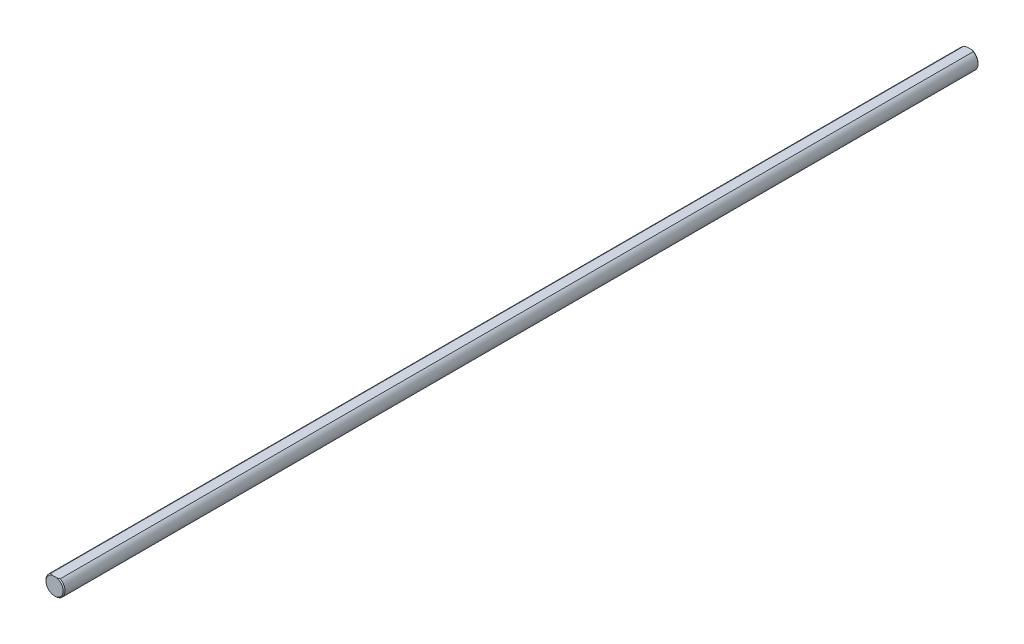
ISO-10303-21;
HEADER;
FILE_DESCRIPTION(('STEP AP214'),'2;1');
FILE_NAME('part.step','',(''),(''),'','','');
FILE_SCHEMA(('AUTOMOTIVE_DESIGN { 1 0 10303 214 1 1 1 1 }'));
ENDSEC;
DATA;
#1=APPLICATION_CONTEXT('core data for automotive mechanical design processes');
#2=APPLICATION_PROTOCOL_DEFINITION('international standard','automotive_design',2000,#1);
#3=PRODUCT_CONTEXT('',#1,'mechanical');
#4=PRODUCT('Part','Part','',(#3));
#5=PRODUCT_RELATED_PRODUCT_CATEGORY('part','',(#4));
#6=PRODUCT_DEFINITION_FORMATION('','',#4);
#7=PRODUCT_DEFINITION_CONTEXT('part definition',#1,'design');
#8=PRODUCT_DEFINITION('design','',#6,#7);
#9=PRODUCT_DEFINITION_SHAPE('','',#8);
#10=(LENGTH_UNIT() NAMED_UNIT(*) SI_UNIT(.MILLI.,.METRE.));
#11=(NAMED_UNIT(*) PLANE_ANGLE_UNIT() SI_UNIT($,.RADIAN.));
#12=(NAMED_UNIT(*) SI_UNIT($,.STERADIAN.) SOLID_ANGLE_UNIT());
#13=UNCERTAINTY_MEASURE_WITH_UNIT(LENGTH_MEASURE(1.E-05),#10,'distance_accuracy_value','');
#14=(GEOMETRIC_REPRESENTATION_CONTEXT(3) GLOBAL_UNCERTAINTY_ASSIGNED_CONTEXT((#13)) GLOBAL_UNIT_ASSIGNED_CONTEXT((#10,
#11,#12)) REPRESENTATION_CONTEXT('',''));
#15=CARTESIAN_POINT('',(0.,0.,0.));
#16=DIRECTION('',(0.,0.,1.));
#17=DIRECTION('',(1.,0.,0.));
#18=AXIS2_PLACEMENT_3D('',#15,#16,#17);
#19=CARTESIAN_POINT('',(0.,0.,152.4));
#20=DIRECTION('',(0.,0.,-1.));
#21=DIRECTION('',(-1.,0.,0.));
#22=AXIS2_PLACEMENT_3D('',#19,#20,#21);
#23=CYLINDRICAL_SURFACE('',#22,3.175);
#24=DIRECTION('',(0.,0.,1.));
#25=VECTOR('',#24,1.);
#26=CARTESIAN_POINT('',(-1.5875,2.74963065701559,-152.4));
#27=LINE('',#26,#25);
#28=CARTESIAN_POINT('',(-1.5875,2.74963065701559,-152.0825));
#29=VERTEX_POINT('',#28);
#30=CARTESIAN_POINT('',(-1.5875,2.74963065701559,152.0825));
#31=VERTEX_POINT('',#30);
#32=EDGE_CURVE('E79',#29,#31,#27,.T.);
#33=ORIENTED_EDGE('',*,*,#32,.F.);
#34=CARTESIAN_POINT('',(0.,0.,-152.0825));
#35=DIRECTION('',(0.,0.,1.));
#36=DIRECTION('',(1.,0.,0.));
#37=AXIS2_PLACEMENT_3D('',#34,#35,#36);
#38=CIRCLE('',#37,3.175);
#39=CARTESIAN_POINT('',(1.5875,2.74963065701559,-152.0825));
#40=VERTEX_POINT('',#39);
#41=EDGE_CURVE('E90',#29,#40,#38,.T.);
#42=ORIENTED_EDGE('',*,*,#41,.T.);
#43=DIRECTION('',(0.,0.,1.));
#44=VECTOR('',#43,1.);
#45=CARTESIAN_POINT('',(1.5875,2.74963065701559,-152.4));
#46=LINE('',#45,#44);
#47=CARTESIAN_POINT('',(1.5875,2.74963065701559,152.0825));
#48=VERTEX_POINT('',#47);
#49=EDGE_CURVE('E92',#40,#48,#46,.T.);
#50=ORIENTED_EDGE('',*,*,#49,.T.);
#51=CARTESIAN_POINT('',(0.,0.,152.0825));
#52=DIRECTION('',(0.,0.,1.));
#53=DIRECTION('',(1.,0.,0.));
#54=AXIS2_PLACEMENT_3D('',#51,#52,#53);
#55=CIRCLE('',#54,3.175);
#56=EDGE_CURVE('E91',#48,#31,#55,.F.);
#57=ORIENTED_EDGE('',*,*,#56,.T.);
#58=EDGE_LOOP('',(#33,#42,#50,#57));
#59=FACE_BOUND('',#58,.T.);
#60=ADVANCED_FACE('F32',(#59),#23,.T.);
#61=CARTESIAN_POINT('',(0.,0.,152.4));
#62=DIRECTION('',(0.,0.,1.));
#63=DIRECTION('',(1.,0.,0.));
#64=AXIS2_PLACEMENT_3D('',#61,#62,#63);
#65=PLANE('',#64);
#66=DIRECTION('',(1.,0.,0.));
#67=VECTOR('',#66,1.);
#68=CARTESIAN_POINT('',(-1.5875,2.74963065701559,152.4));
#69=LINE('',#68,#67);
#70=CARTESIAN_POINT('',(-0.777712993334318,2.74963065701559,152.4));
#71=VERTEX_POINT('',#70);
#72=CARTESIAN_POINT('',(0.777712993334318,2.74963065701559,152.4));
#73=VERTEX_POINT('',#72);
#74=EDGE_CURVE('E137',#71,#73,#69,.T.);
#75=ORIENTED_EDGE('',*,*,#74,.F.);
#76=CARTESIAN_POINT('',(0.,0.,152.4));
#77=DIRECTION('',(0.,0.,1.));
#78=DIRECTION('',(1.,0.,0.));
#79=AXIS2_PLACEMENT_3D('',#76,#77,#78);
#80=CIRCLE('',#79,2.85750000000018);
#81=EDGE_CURVE('E11',#71,#73,#80,.T.);
#82=ORIENTED_EDGE('',*,*,#81,.T.);
#83=EDGE_LOOP('',(#75,#82));
#84=FACE_BOUND('',#83,.T.);
#85=ADVANCED_FACE('F130',(#84),#65,.T.);
#86=CARTESIAN_POINT('',(0.,0.,-152.4));
#87=DIRECTION('',(0.,0.,1.));
#88=DIRECTION('',(1.,0.,0.));
#89=AXIS2_PLACEMENT_3D('',#86,#87,#88);
#90=PLANE('',#89);
#91=DIRECTION('',(1.,0.,0.));
#92=VECTOR('',#91,1.);
#93=CARTESIAN_POINT('',(-1.5875,2.74963065701559,-152.4));
#94=LINE('',#93,#92);
#95=CARTESIAN_POINT('',(-0.77771299333289,2.74963065701559,-152.4));
#96=VERTEX_POINT('',#95);
#97=CARTESIAN_POINT('',(0.77771299333289,2.74963065701559,-152.4));
#98=VERTEX_POINT('',#97);
#99=EDGE_CURVE('E81',#96,#98,#94,.T.);
#100=ORIENTED_EDGE('',*,*,#99,.T.);
#101=CARTESIAN_POINT('',(0.,0.,-152.4));
#102=DIRECTION('',(0.,0.,1.));
#103=DIRECTION('',(1.,0.,0.));
#104=AXIS2_PLACEMENT_3D('',#101,#102,#103);
#105=CIRCLE('',#104,2.85749999999979);
#106=EDGE_CURVE('E41',#98,#96,#105,.F.);
#107=ORIENTED_EDGE('',*,*,#106,.T.);
#108=EDGE_LOOP('',(#100,#107));
#109=FACE_BOUND('',#108,.T.);
#110=ADVANCED_FACE('F111',(#109),#90,.F.);
#111=CARTESIAN_POINT('',(-1.5875,2.74963065701559,-152.4));
#112=DIRECTION('',(0.,-1.,0.));
#113=DIRECTION('',(0.,0.,-1.));
#114=AXIS2_PLACEMENT_3D('',#111,#112,#113);
#115=PLANE('',#114);
#116=ORIENTED_EDGE('',*,*,#49,.F.);
#117=CARTESIAN_POINT('',(1.5875,2.74963065701559,-152.0825));
#118=CARTESIAN_POINT('',(1.52250516699264,2.74963065701559,-152.11498808248));
#119=CARTESIAN_POINT('',(1.45690188238018,2.74963065701559,-152.146301907619));
#120=CARTESIAN_POINT('',(1.32458227076998,2.74963065701559,-152.206025851425));
#121=CARTESIAN_POINT('',(1.25786903887703,2.74963065701559,-152.234442847017));
#122=CARTESIAN_POINT('',(1.12308918002454,2.74963065701559,-152.287992005704));
#123=CARTESIAN_POINT('',(1.05502199036127,2.74963065701559,-152.313122768734));
#124=CARTESIAN_POINT('',(0.917422256787349,2.74963065701559,-152.359582195948));
#125=CARTESIAN_POINT('',(0.847886543274815,2.74963065701559,-152.380901435531));
#126=CARTESIAN_POINT('',(0.777712993332883,2.74963065701559,-152.4));
#127=B_SPLINE_CURVE_WITH_KNOTS('',3,(#117,#118,#119,#120,#121,#122,#123,#124,#125,#126),
.UNSPECIFIED.,.F.,.F.,(4,2,2,2,4),(0.,0.218002568777972,0.435474929897561,0.653039643131156,
0.871135095681379),.UNSPECIFIED.);
#128=EDGE_CURVE('E85',#40,#98,#127,.T.);
#129=ORIENTED_EDGE('',*,*,#128,.T.);
#130=ORIENTED_EDGE('',*,*,#99,.F.);
#131=CARTESIAN_POINT('',(-0.77771299333289,2.74963065701559,-152.4));
#132=CARTESIAN_POINT('',(-0.847886543274821,2.74963065701559,-152.380901435531));
#133=CARTESIAN_POINT('',(-0.917422256787353,2.74963065701559,-152.359582195948));
#134=CARTESIAN_POINT('',(-1.05502199036128,2.74963065701559,-152.313122768734));
#135=CARTESIAN_POINT('',(-1.12308918002455,2.74963065701559,-152.287992005704));
#136=CARTESIAN_POINT('',(-1.25786903887703,2.74963065701559,-152.234442847017));
#137=CARTESIAN_POINT('',(-1.32458227076998,2.74963065701559,-152.206025851425));
#138=CARTESIAN_POINT('',(-1.45690188238017,2.74963065701559,-152.146301907619));
#139=CARTESIAN_POINT('',(-1.52250516699263,2.74963065701559,-152.11498808248));
#140=CARTESIAN_POINT('',(-1.5875,2.74963065701559,-152.0825));
#141=B_SPLINE_CURVE_WITH_KNOTS('',3,(#131,#132,#133,#134,#135,#136,#137,#138,#139,#140),
.UNSPECIFIED.,.F.,.F.,(4,2,2,2,4),(0.,0.21809545255022,0.435660165783814,0.653132526903393,
0.871135095681371),.UNSPECIFIED.);
#142=EDGE_CURVE('E75',#96,#29,#141,.T.);
#143=ORIENTED_EDGE('',*,*,#142,.T.);
#144=ORIENTED_EDGE('',*,*,#32,.T.);
#145=CARTESIAN_POINT('',(-1.5875,2.74963065701559,152.0825));
#146=CARTESIAN_POINT('',(-1.52250516699275,2.74963065701559,152.11498808248));
#147=CARTESIAN_POINT('',(-1.4569018823804,2.74963065701559,152.14630190762));
#148=CARTESIAN_POINT('',(-1.32458227077043,2.74963065701559,152.206025851425));
#149=CARTESIAN_POINT('',(-1.25786903887759,2.74963065701559,152.234442847017));
#150=CARTESIAN_POINT('',(-1.12308918002534,2.74963065701559,152.287992005704));
#151=CARTESIAN_POINT('',(-1.0550219903622,2.74963065701559,152.313122768734));
#152=CARTESIAN_POINT('',(-0.917422256788531,2.74963065701559,152.359582195948));
#153=CARTESIAN_POINT('',(-0.84788654327613,2.74963065701559,152.380901435531));
#154=CARTESIAN_POINT('',(-0.777712993334327,2.74963065701559,152.4));
#155=B_SPLINE_CURVE_WITH_KNOTS('',3,(#145,#146,#147,#148,#149,#150,#151,#152,#153,#154),
.UNSPECIFIED.,.F.,.F.,(4,2,2,2,4),(0.,0.218002568777616,0.435474929896812,0.653039643130032,
0.871135095679873),.UNSPECIFIED.);
#156=EDGE_CURVE('E55',#31,#71,#155,.T.);
#157=ORIENTED_EDGE('',*,*,#156,.T.);
#158=ORIENTED_EDGE('',*,*,#74,.T.);
#159=CARTESIAN_POINT('',(0.777712993334318,2.74963065701559,152.4));
#160=CARTESIAN_POINT('',(0.847886543276122,2.74963065701559,152.380901435531));
#161=CARTESIAN_POINT('',(0.917422256788525,2.74963065701559,152.359582195948));
#162=CARTESIAN_POINT('',(1.05502199036219,2.74963065701559,152.313122768734));
#163=CARTESIAN_POINT('',(1.12308918002534,2.74963065701559,152.287992005704));
#164=CARTESIAN_POINT('',(1.25786903887759,2.74963065701559,152.234442847017));
#165=CARTESIAN_POINT('',(1.32458227077043,2.74963065701559,152.206025851425));
#166=CARTESIAN_POINT('',(1.4569018823804,2.74963065701559,152.14630190762));
#167=CARTESIAN_POINT('',(1.52250516699275,2.74963065701559,152.11498808248));
#168=CARTESIAN_POINT('',(1.5875,2.74963065701559,152.0825));
#169=B_SPLINE_CURVE_WITH_KNOTS('',3,(#159,#160,#161,#162,#163,#164,#165,#166,#167,#168),
.UNSPECIFIED.,.F.,.F.,(4,2,2,2,4),(0.,0.218095452549845,0.435660165783067,0.653132526902265,
0.871135095679883),.UNSPECIFIED.);
#170=EDGE_CURVE('E48',#73,#48,#169,.T.);
#171=ORIENTED_EDGE('',*,*,#170,.T.);
#172=EDGE_LOOP('',(#116,#129,#130,#143,#144,#157,#158,#171));
#173=FACE_BOUND('',#172,.T.);
#174=ADVANCED_FACE('F78',(#173),#115,.F.);
#175=CARTESIAN_POINT('',(0.,0.,-152.0825));
#176=DIRECTION('',(0.,0.,1.));
#177=DIRECTION('',(1.,0.,0.));
#178=AXIS2_PLACEMENT_3D('',#175,#176,#177);
#179=CONICAL_SURFACE('',#178,3.175,0.785398163397388);
#180=ORIENTED_EDGE('',*,*,#142,.F.);
#181=ORIENTED_EDGE('',*,*,#106,.F.);
#182=ORIENTED_EDGE('',*,*,#128,.F.);
#183=ORIENTED_EDGE('',*,*,#41,.F.);
#184=EDGE_LOOP('',(#180,#181,#182,#183));
#185=FACE_BOUND('',#184,.T.);
#186=ADVANCED_FACE('F94',(#185),#179,.T.);
#187=CARTESIAN_POINT('',(0.,0.,152.4));
#188=DIRECTION('',(0.,0.,-1.));
#189=DIRECTION('',(-1.,0.,0.));
#190=AXIS2_PLACEMENT_3D('',#187,#188,#189);
#191=CONICAL_SURFACE('',#190,2.85750000000018,0.785398163397431);
#192=ORIENTED_EDGE('',*,*,#156,.F.);
#193=ORIENTED_EDGE('',*,*,#56,.F.);
#194=ORIENTED_EDGE('',*,*,#170,.F.);
#195=ORIENTED_EDGE('',*,*,#81,.F.);
#196=EDGE_LOOP('',(#192,#193,#194,#195));
#197=FACE_BOUND('',#196,.T.);
#198=ADVANCED_FACE('F34',(#197),#191,.T.);
#199=CLOSED_SHELL('',(#60,#85,#110,#174,#186,#198));
#200=MANIFOLD_SOLID_BREP('B2',#199);
#201=ADVANCED_BREP_SHAPE_REPRESENTATION('',(#18,#200),#14);
#202=SHAPE_DEFINITION_REPRESENTATION(#9,#201);
ENDSEC;
END-ISO-10303-21;
